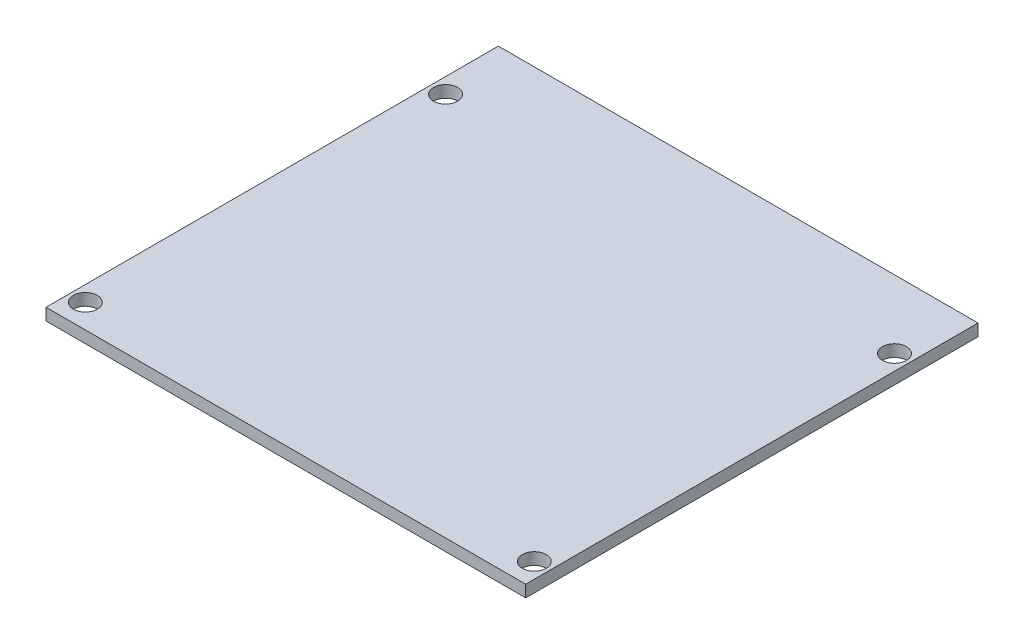
ISO-10303-21;
HEADER;
FILE_DESCRIPTION(('STEP AP214'),'2;1');
FILE_NAME('part.step','',(''),(''),'','','');
FILE_SCHEMA(('AUTOMOTIVE_DESIGN { 1 0 10303 214 1 1 1 1 }'));
ENDSEC;
DATA;
#1=APPLICATION_CONTEXT('core data for automotive mechanical design processes');
#2=APPLICATION_PROTOCOL_DEFINITION('international standard','automotive_design',2000,#1);
#3=PRODUCT_CONTEXT('',#1,'mechanical');
#4=PRODUCT('Part','Part','',(#3));
#5=PRODUCT_RELATED_PRODUCT_CATEGORY('part','',(#4));
#6=PRODUCT_DEFINITION_FORMATION('','',#4);
#7=PRODUCT_DEFINITION_CONTEXT('part definition',#1,'design');
#8=PRODUCT_DEFINITION('design','',#6,#7);
#9=PRODUCT_DEFINITION_SHAPE('','',#8);
#10=(LENGTH_UNIT() NAMED_UNIT(*) SI_UNIT(.MILLI.,.METRE.));
#11=(NAMED_UNIT(*) PLANE_ANGLE_UNIT() SI_UNIT($,.RADIAN.));
#12=(NAMED_UNIT(*) SI_UNIT($,.STERADIAN.) SOLID_ANGLE_UNIT());
#13=UNCERTAINTY_MEASURE_WITH_UNIT(LENGTH_MEASURE(1.E-05),#10,'distance_accuracy_value','');
#14=(GEOMETRIC_REPRESENTATION_CONTEXT(3) GLOBAL_UNCERTAINTY_ASSIGNED_CONTEXT((#13)) GLOBAL_UNIT_ASSIGNED_CONTEXT((#10,
#11,#12)) REPRESENTATION_CONTEXT('',''));
#15=CARTESIAN_POINT('',(0.,0.,0.));
#16=DIRECTION('',(0.,0.,1.));
#17=DIRECTION('',(1.,0.,0.));
#18=AXIS2_PLACEMENT_3D('',#15,#16,#17);
#19=CARTESIAN_POINT('',(32.024999958,0.79375,30.200000052));
#20=DIRECTION('',(-1.,0.,0.));
#21=DIRECTION('',(0.,0.,1.));
#22=AXIS2_PLACEMENT_3D('',#19,#20,#21);
#23=PLANE('',#22);
#24=DIRECTION('',(0.,0.,-1.));
#25=VECTOR('',#24,1.);
#26=CARTESIAN_POINT('',(32.024999958,-0.79375,30.200000052));
#27=LINE('',#26,#25);
#28=CARTESIAN_POINT('',(32.024999958,-0.79375,30.200000052));
#29=VERTEX_POINT('',#28);
#30=CARTESIAN_POINT('',(32.024999958,-0.79375,-30.200000052));
#31=VERTEX_POINT('',#30);
#32=EDGE_CURVE('E102',#29,#31,#27,.T.);
#33=ORIENTED_EDGE('',*,*,#32,.T.);
#34=DIRECTION('',(0.,-1.,0.));
#35=VECTOR('',#34,1.);
#36=CARTESIAN_POINT('',(32.024999958,0.79375,-30.200000052));
#37=LINE('',#36,#35);
#38=CARTESIAN_POINT('',(32.024999958,0.79375,-30.200000052));
#39=VERTEX_POINT('',#38);
#40=EDGE_CURVE('E11',#39,#31,#37,.T.);
#41=ORIENTED_EDGE('',*,*,#40,.F.);
#42=DIRECTION('',(0.,0.,-1.));
#43=VECTOR('',#42,1.);
#44=CARTESIAN_POINT('',(32.024999958,0.79375,30.200000052));
#45=LINE('',#44,#43);
#46=CARTESIAN_POINT('',(32.024999958,0.79375,30.200000052));
#47=VERTEX_POINT('',#46);
#48=EDGE_CURVE('E90',#47,#39,#45,.T.);
#49=ORIENTED_EDGE('',*,*,#48,.F.);
#50=DIRECTION('',(0.,-1.,0.));
#51=VECTOR('',#50,1.);
#52=CARTESIAN_POINT('',(32.024999958,0.79375,30.200000052));
#53=LINE('',#52,#51);
#54=EDGE_CURVE('E98',#47,#29,#53,.T.);
#55=ORIENTED_EDGE('',*,*,#54,.T.);
#56=EDGE_LOOP('',(#33,#41,#49,#55));
#57=FACE_BOUND('',#56,.T.);
#58=ADVANCED_FACE('F39',(#57),#23,.F.);
#59=CARTESIAN_POINT('',(-32.024999958,0.79375,-30.200000052));
#60=DIRECTION('',(0.,0.,1.));
#61=DIRECTION('',(1.,0.,0.));
#62=AXIS2_PLACEMENT_3D('',#59,#60,#61);
#63=PLANE('',#62);
#64=DIRECTION('',(-1.,0.,0.));
#65=VECTOR('',#64,1.);
#66=CARTESIAN_POINT('',(-32.024999958,-0.79375,-30.200000052));
#67=LINE('',#66,#65);
#68=CARTESIAN_POINT('',(-32.024999958,-0.79375,-30.200000052));
#69=VERTEX_POINT('',#68);
#70=EDGE_CURVE('E94',#31,#69,#67,.T.);
#71=ORIENTED_EDGE('',*,*,#70,.T.);
#72=DIRECTION('',(0.,-1.,0.));
#73=VECTOR('',#72,1.);
#74=CARTESIAN_POINT('',(-32.024999958,0.79375,-30.200000052));
#75=LINE('',#74,#73);
#76=CARTESIAN_POINT('',(-32.024999958,0.79375,-30.200000052));
#77=VERTEX_POINT('',#76);
#78=EDGE_CURVE('E47',#77,#69,#75,.T.);
#79=ORIENTED_EDGE('',*,*,#78,.F.);
#80=DIRECTION('',(-1.,0.,0.));
#81=VECTOR('',#80,1.);
#82=CARTESIAN_POINT('',(-32.024999958,0.79375,-30.200000052));
#83=LINE('',#82,#81);
#84=EDGE_CURVE('E85',#39,#77,#83,.T.);
#85=ORIENTED_EDGE('',*,*,#84,.F.);
#86=ORIENTED_EDGE('',*,*,#40,.T.);
#87=EDGE_LOOP('',(#71,#79,#85,#86));
#88=FACE_BOUND('',#87,.T.);
#89=ADVANCED_FACE('F93',(#88),#63,.F.);
#90=CARTESIAN_POINT('',(-32.024999958,0.79375,30.200000052));
#91=DIRECTION('',(1.,0.,0.));
#92=DIRECTION('',(0.,0.,-1.));
#93=AXIS2_PLACEMENT_3D('',#90,#91,#92);
#94=PLANE('',#93);
#95=DIRECTION('',(0.,0.,1.));
#96=VECTOR('',#95,1.);
#97=CARTESIAN_POINT('',(-32.024999958,-0.79375,30.200000052));
#98=LINE('',#97,#96);
#99=CARTESIAN_POINT('',(-32.024999958,-0.79375,30.200000052));
#100=VERTEX_POINT('',#99);
#101=EDGE_CURVE('E72',#69,#100,#98,.T.);
#102=ORIENTED_EDGE('',*,*,#101,.T.);
#103=DIRECTION('',(0.,-1.,0.));
#104=VECTOR('',#103,1.);
#105=CARTESIAN_POINT('',(-32.024999958,0.79375,30.200000052));
#106=LINE('',#105,#104);
#107=CARTESIAN_POINT('',(-32.024999958,0.79375,30.200000052));
#108=VERTEX_POINT('',#107);
#109=EDGE_CURVE('E95',#108,#100,#106,.T.);
#110=ORIENTED_EDGE('',*,*,#109,.F.);
#111=DIRECTION('',(0.,0.,1.));
#112=VECTOR('',#111,1.);
#113=CARTESIAN_POINT('',(-32.024999958,0.79375,30.200000052));
#114=LINE('',#113,#112);
#115=EDGE_CURVE('E88',#77,#108,#114,.T.);
#116=ORIENTED_EDGE('',*,*,#115,.F.);
#117=ORIENTED_EDGE('',*,*,#78,.T.);
#118=EDGE_LOOP('',(#102,#110,#116,#117));
#119=FACE_BOUND('',#118,.T.);
#120=ADVANCED_FACE('F96',(#119),#94,.F.);
#121=CARTESIAN_POINT('',(-32.024999958,0.79375,30.200000052));
#122=DIRECTION('',(0.,0.,-1.));
#123=DIRECTION('',(-1.,0.,0.));
#124=AXIS2_PLACEMENT_3D('',#121,#122,#123);
#125=PLANE('',#124);
#126=DIRECTION('',(1.,0.,0.));
#127=VECTOR('',#126,1.);
#128=CARTESIAN_POINT('',(-32.024999958,-0.79375,30.200000052));
#129=LINE('',#128,#127);
#130=EDGE_CURVE('E78',#100,#29,#129,.T.);
#131=ORIENTED_EDGE('',*,*,#130,.T.);
#132=ORIENTED_EDGE('',*,*,#54,.F.);
#133=DIRECTION('',(1.,0.,0.));
#134=VECTOR('',#133,1.);
#135=CARTESIAN_POINT('',(-32.024999958,0.79375,30.200000052));
#136=LINE('',#135,#134);
#137=EDGE_CURVE('E55',#108,#47,#136,.T.);
#138=ORIENTED_EDGE('',*,*,#137,.F.);
#139=ORIENTED_EDGE('',*,*,#109,.T.);
#140=EDGE_LOOP('',(#131,#132,#138,#139));
#141=FACE_BOUND('',#140,.T.);
#142=ADVANCED_FACE('F110',(#141),#125,.F.);
#143=CARTESIAN_POINT('',(0.,0.79375,0.));
#144=DIRECTION('',(0.,-1.,0.));
#145=DIRECTION('',(0.,0.,-1.));
#146=AXIS2_PLACEMENT_3D('',#143,#144,#145);
#147=PLANE('',#146);
#148=CARTESIAN_POINT('',(-29.972,0.79375,27.000000102));
#149=DIRECTION('',(0.,1.,0.));
#150=DIRECTION('',(0.,0.,1.));
#151=AXIS2_PLACEMENT_3D('',#148,#149,#150);
#152=CIRCLE('',#151,1.599999975);
#153=CARTESIAN_POINT('',(-29.972,0.79375,28.600000077));
#154=VERTEX_POINT('',#153);
#155=EDGE_CURVE('E122',#154,#154,#152,.T.);
#156=ORIENTED_EDGE('',*,*,#155,.F.);
#157=EDGE_LOOP('',(#156));
#158=FACE_BOUND('',#157,.T.);
#159=CARTESIAN_POINT('',(29.972,0.79375,27.000000102));
#160=DIRECTION('',(0.,1.,0.));
#161=DIRECTION('',(0.,0.,1.));
#162=AXIS2_PLACEMENT_3D('',#159,#160,#161);
#163=CIRCLE('',#162,1.59999997500001);
#164=CARTESIAN_POINT('',(29.972,0.79375,28.600000077));
#165=VERTEX_POINT('',#164);
#166=EDGE_CURVE('E129',#165,#165,#163,.T.);
#167=ORIENTED_EDGE('',*,*,#166,.F.);
#168=EDGE_LOOP('',(#167));
#169=FACE_BOUND('',#168,.T.);
#170=CARTESIAN_POINT('',(29.972,0.79375,-21.099999964));
#171=DIRECTION('',(0.,1.,0.));
#172=DIRECTION('',(0.,0.,1.));
#173=AXIS2_PLACEMENT_3D('',#170,#171,#172);
#174=CIRCLE('',#173,1.59999997500001);
#175=CARTESIAN_POINT('',(29.972,0.79375,-19.499999989));
#176=VERTEX_POINT('',#175);
#177=EDGE_CURVE('E121',#176,#176,#174,.T.);
#178=ORIENTED_EDGE('',*,*,#177,.F.);
#179=EDGE_LOOP('',(#178));
#180=FACE_BOUND('',#179,.T.);
#181=CARTESIAN_POINT('',(-29.972,0.79375,-21.099999964));
#182=DIRECTION('',(0.,1.,0.));
#183=DIRECTION('',(0.,0.,1.));
#184=AXIS2_PLACEMENT_3D('',#181,#182,#183);
#185=CIRCLE('',#184,1.599999975);
#186=CARTESIAN_POINT('',(-29.972,0.79375,-19.499999989));
#187=VERTEX_POINT('',#186);
#188=EDGE_CURVE('E118',#187,#187,#185,.T.);
#189=ORIENTED_EDGE('',*,*,#188,.F.);
#190=EDGE_LOOP('',(#189));
#191=FACE_BOUND('',#190,.T.);
#192=ORIENTED_EDGE('',*,*,#48,.T.);
#193=ORIENTED_EDGE('',*,*,#84,.T.);
#194=ORIENTED_EDGE('',*,*,#115,.T.);
#195=ORIENTED_EDGE('',*,*,#137,.T.);
#196=EDGE_LOOP('',(#192,#193,#194,#195));
#197=FACE_BOUND('',#196,.T.);
#198=ADVANCED_FACE('F86',(#158,#169,#180,#191,#197),#147,.F.);
#199=CARTESIAN_POINT('',(0.,-0.79375,0.));
#200=DIRECTION('',(0.,-1.,0.));
#201=DIRECTION('',(0.,0.,-1.));
#202=AXIS2_PLACEMENT_3D('',#199,#200,#201);
#203=PLANE('',#202);
#204=CARTESIAN_POINT('',(-29.972,-0.79375,27.000000102));
#205=DIRECTION('',(0.,1.,0.));
#206=DIRECTION('',(0.,0.,1.));
#207=AXIS2_PLACEMENT_3D('',#204,#205,#206);
#208=CIRCLE('',#207,1.599999975);
#209=CARTESIAN_POINT('',(-29.972,-0.79375,28.600000077));
#210=VERTEX_POINT('',#209);
#211=EDGE_CURVE('E126',#210,#210,#208,.T.);
#212=ORIENTED_EDGE('',*,*,#211,.T.);
#213=EDGE_LOOP('',(#212));
#214=FACE_BOUND('',#213,.T.);
#215=CARTESIAN_POINT('',(29.972,-0.79375,27.000000102));
#216=DIRECTION('',(0.,1.,0.));
#217=DIRECTION('',(0.,0.,1.));
#218=AXIS2_PLACEMENT_3D('',#215,#216,#217);
#219=CIRCLE('',#218,1.59999997500001);
#220=CARTESIAN_POINT('',(29.972,-0.79375,28.600000077));
#221=VERTEX_POINT('',#220);
#222=EDGE_CURVE('E125',#221,#221,#219,.T.);
#223=ORIENTED_EDGE('',*,*,#222,.T.);
#224=EDGE_LOOP('',(#223));
#225=FACE_BOUND('',#224,.T.);
#226=CARTESIAN_POINT('',(29.972,-0.79375,-21.099999964));
#227=DIRECTION('',(0.,1.,0.));
#228=DIRECTION('',(0.,0.,1.));
#229=AXIS2_PLACEMENT_3D('',#226,#227,#228);
#230=CIRCLE('',#229,1.59999997500001);
#231=CARTESIAN_POINT('',(29.972,-0.79375,-19.499999989));
#232=VERTEX_POINT('',#231);
#233=EDGE_CURVE('E132',#232,#232,#230,.T.);
#234=ORIENTED_EDGE('',*,*,#233,.T.);
#235=EDGE_LOOP('',(#234));
#236=FACE_BOUND('',#235,.T.);
#237=CARTESIAN_POINT('',(-29.972,-0.79375,-21.099999964));
#238=DIRECTION('',(0.,1.,0.));
#239=DIRECTION('',(0.,0.,1.));
#240=AXIS2_PLACEMENT_3D('',#237,#238,#239);
#241=CIRCLE('',#240,1.599999975);
#242=CARTESIAN_POINT('',(-29.972,-0.79375,-19.499999989));
#243=VERTEX_POINT('',#242);
#244=EDGE_CURVE('E105',#243,#243,#241,.T.);
#245=ORIENTED_EDGE('',*,*,#244,.T.);
#246=EDGE_LOOP('',(#245));
#247=FACE_BOUND('',#246,.T.);
#248=ORIENTED_EDGE('',*,*,#32,.F.);
#249=ORIENTED_EDGE('',*,*,#130,.F.);
#250=ORIENTED_EDGE('',*,*,#101,.F.);
#251=ORIENTED_EDGE('',*,*,#70,.F.);
#252=EDGE_LOOP('',(#248,#249,#250,#251));
#253=FACE_BOUND('',#252,.T.);
#254=ADVANCED_FACE('F113',(#214,#225,#236,#247,#253),#203,.T.);
#255=CARTESIAN_POINT('',(-29.972,-0.79375,-21.099999964));
#256=DIRECTION('',(0.,1.,0.));
#257=DIRECTION('',(0.,0.,1.));
#258=AXIS2_PLACEMENT_3D('',#255,#256,#257);
#259=CYLINDRICAL_SURFACE('',#258,1.599999975);
#260=ORIENTED_EDGE('',*,*,#244,.F.);
#261=EDGE_LOOP('',(#260));
#262=FACE_BOUND('',#261,.T.);
#263=ORIENTED_EDGE('',*,*,#188,.T.);
#264=EDGE_LOOP('',(#263));
#265=FACE_BOUND('',#264,.T.);
#266=ADVANCED_FACE('F146',(#262,#265),#259,.F.);
#267=CARTESIAN_POINT('',(29.972,-0.79375,-21.099999964));
#268=DIRECTION('',(0.,1.,0.));
#269=DIRECTION('',(0.,0.,1.));
#270=AXIS2_PLACEMENT_3D('',#267,#268,#269);
#271=CYLINDRICAL_SURFACE('',#270,1.59999997500001);
#272=ORIENTED_EDGE('',*,*,#233,.F.);
#273=EDGE_LOOP('',(#272));
#274=FACE_BOUND('',#273,.T.);
#275=ORIENTED_EDGE('',*,*,#177,.T.);
#276=EDGE_LOOP('',(#275));
#277=FACE_BOUND('',#276,.T.);
#278=ADVANCED_FACE('F142',(#274,#277),#271,.F.);
#279=CARTESIAN_POINT('',(29.972,-0.79375,27.000000102));
#280=DIRECTION('',(0.,1.,0.));
#281=DIRECTION('',(0.,0.,1.));
#282=AXIS2_PLACEMENT_3D('',#279,#280,#281);
#283=CYLINDRICAL_SURFACE('',#282,1.59999997500001);
#284=ORIENTED_EDGE('',*,*,#222,.F.);
#285=EDGE_LOOP('',(#284));
#286=FACE_BOUND('',#285,.T.);
#287=ORIENTED_EDGE('',*,*,#166,.T.);
#288=EDGE_LOOP('',(#287));
#289=FACE_BOUND('',#288,.T.);
#290=ADVANCED_FACE('F145',(#286,#289),#283,.F.);
#291=CARTESIAN_POINT('',(-29.972,-0.79375,27.000000102));
#292=DIRECTION('',(0.,1.,0.));
#293=DIRECTION('',(0.,0.,1.));
#294=AXIS2_PLACEMENT_3D('',#291,#292,#293);
#295=CYLINDRICAL_SURFACE('',#294,1.599999975);
#296=ORIENTED_EDGE('',*,*,#211,.F.);
#297=EDGE_LOOP('',(#296));
#298=FACE_BOUND('',#297,.T.);
#299=ORIENTED_EDGE('',*,*,#155,.T.);
#300=EDGE_LOOP('',(#299));
#301=FACE_BOUND('',#300,.T.);
#302=ADVANCED_FACE('F210',(#298,#301),#295,.F.);
#303=CLOSED_SHELL('',(#58,#89,#120,#142,#198,#254,#266,#278,#290,#302));
#304=MANIFOLD_SOLID_BREP('B2',#303);
#305=ADVANCED_BREP_SHAPE_REPRESENTATION('',(#18,#304),#14);
#306=SHAPE_DEFINITION_REPRESENTATION(#9,#305);
ENDSEC;
END-ISO-10303-21;
